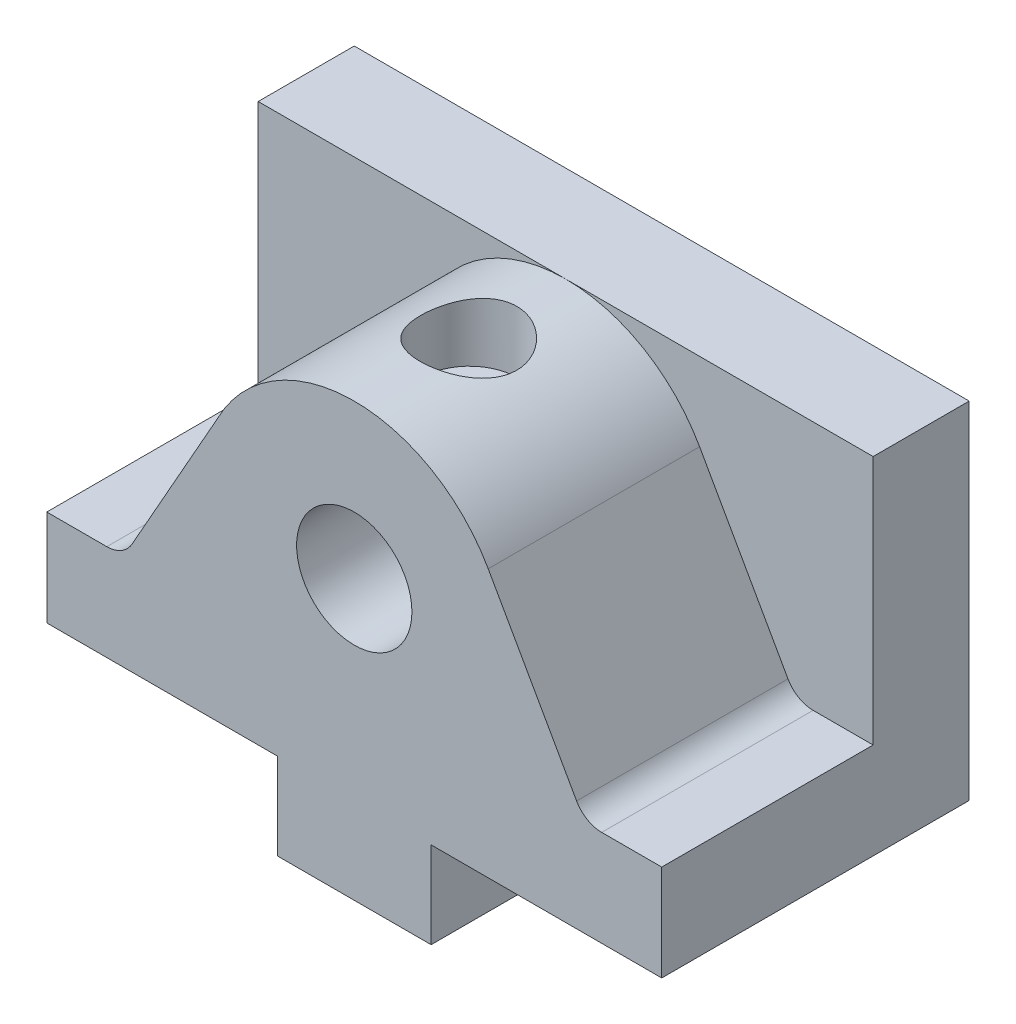
ISO-10303-21;
HEADER;
FILE_DESCRIPTION(('STEP AP214'),'2;1');
FILE_NAME('part.step','',(''),(''),'','','');
FILE_SCHEMA(('AUTOMOTIVE_DESIGN { 1 0 10303 214 1 1 1 1 }'));
ENDSEC;
DATA;
#1=APPLICATION_CONTEXT('core data for automotive mechanical design processes');
#2=APPLICATION_PROTOCOL_DEFINITION('international standard','automotive_design',2000,#1);
#3=PRODUCT_CONTEXT('',#1,'mechanical');
#4=PRODUCT('Part','Part','',(#3));
#5=PRODUCT_RELATED_PRODUCT_CATEGORY('part','',(#4));
#6=PRODUCT_DEFINITION_FORMATION('','',#4);
#7=PRODUCT_DEFINITION_CONTEXT('part definition',#1,'design');
#8=PRODUCT_DEFINITION('design','',#6,#7);
#9=PRODUCT_DEFINITION_SHAPE('','',#8);
#10=(LENGTH_UNIT() NAMED_UNIT(*) SI_UNIT(.MILLI.,.METRE.));
#11=(NAMED_UNIT(*) PLANE_ANGLE_UNIT() SI_UNIT($,.RADIAN.));
#12=(NAMED_UNIT(*) SI_UNIT($,.STERADIAN.) SOLID_ANGLE_UNIT());
#13=UNCERTAINTY_MEASURE_WITH_UNIT(LENGTH_MEASURE(1.E-05),#10,'distance_accuracy_value','');
#14=(GEOMETRIC_REPRESENTATION_CONTEXT(3) GLOBAL_UNCERTAINTY_ASSIGNED_CONTEXT((#13)) GLOBAL_UNIT_ASSIGNED_CONTEXT((#10,
#11,#12)) REPRESENTATION_CONTEXT('',''));
#15=CARTESIAN_POINT('',(0.,0.,0.));
#16=DIRECTION('',(0.,0.,1.));
#17=DIRECTION('',(1.,0.,0.));
#18=AXIS2_PLACEMENT_3D('',#15,#16,#17);
#19=CARTESIAN_POINT('',(0.,0.,0.));
#20=DIRECTION('',(0.,1.,0.));
#21=DIRECTION('',(0.,0.,1.));
#22=AXIS2_PLACEMENT_3D('',#19,#20,#21);
#23=PLANE('',#22);
#24=DIRECTION('',(0.,0.,1.));
#25=VECTOR('',#24,1.);
#26=CARTESIAN_POINT('',(8.,0.,16.));
#27=LINE('',#26,#25);
#28=CARTESIAN_POINT('',(8.,0.,-16.));
#29=VERTEX_POINT('',#28);
#30=CARTESIAN_POINT('',(8.,0.,16.));
#31=VERTEX_POINT('',#30);
#32=EDGE_CURVE('E54',#29,#31,#27,.T.);
#33=ORIENTED_EDGE('',*,*,#32,.F.);
#34=DIRECTION('',(-1.,0.,0.));
#35=VECTOR('',#34,1.);
#36=CARTESIAN_POINT('',(-32.,0.,-16.));
#37=LINE('',#36,#35);
#38=CARTESIAN_POINT('',(32.,0.,-16.));
#39=VERTEX_POINT('',#38);
#40=EDGE_CURVE('E254',#39,#29,#37,.T.);
#41=ORIENTED_EDGE('',*,*,#40,.F.);
#42=DIRECTION('',(0.,0.,-1.));
#43=VECTOR('',#42,1.);
#44=CARTESIAN_POINT('',(32.,0.,-16.));
#45=LINE('',#44,#43);
#46=CARTESIAN_POINT('',(32.,0.,16.));
#47=VERTEX_POINT('',#46);
#48=EDGE_CURVE('E354',#47,#39,#45,.T.);
#49=ORIENTED_EDGE('',*,*,#48,.F.);
#50=DIRECTION('',(1.,0.,0.));
#51=VECTOR('',#50,1.);
#52=CARTESIAN_POINT('',(-32.,0.,16.));
#53=LINE('',#52,#51);
#54=EDGE_CURVE('E59',#31,#47,#53,.T.);
#55=ORIENTED_EDGE('',*,*,#54,.F.);
#56=EDGE_LOOP('',(#33,#41,#49,#55));
#57=FACE_BOUND('',#56,.T.);
#58=ADVANCED_FACE('F34',(#57),#23,.F.);
#59=DIRECTION('',(0.,0.,-1.));
#60=VECTOR('',#59,1.);
#61=CARTESIAN_POINT('',(-8.,0.,16.));
#62=LINE('',#61,#60);
#63=CARTESIAN_POINT('',(-8.,0.,16.));
#64=VERTEX_POINT('',#63);
#65=CARTESIAN_POINT('',(-8.,0.,-16.));
#66=VERTEX_POINT('',#65);
#67=EDGE_CURVE('E278',#64,#66,#62,.T.);
#68=ORIENTED_EDGE('',*,*,#67,.F.);
#69=CARTESIAN_POINT('',(-32.,0.,16.));
#70=VERTEX_POINT('',#69);
#71=EDGE_CURVE('E363',#70,#64,#53,.T.);
#72=ORIENTED_EDGE('',*,*,#71,.F.);
#73=DIRECTION('',(0.,0.,1.));
#74=VECTOR('',#73,1.);
#75=CARTESIAN_POINT('',(-32.,0.,-16.));
#76=LINE('',#75,#74);
#77=CARTESIAN_POINT('',(-32.,0.,-16.));
#78=VERTEX_POINT('',#77);
#79=EDGE_CURVE('E262',#78,#70,#76,.T.);
#80=ORIENTED_EDGE('',*,*,#79,.F.);
#81=EDGE_CURVE('E263',#66,#78,#37,.T.);
#82=ORIENTED_EDGE('',*,*,#81,.F.);
#83=EDGE_LOOP('',(#68,#72,#80,#82));
#84=FACE_BOUND('',#83,.T.);
#85=ADVANCED_FACE('F223',(#84),#23,.F.);
#86=CARTESIAN_POINT('',(0.,36.,0.));
#87=DIRECTION('',(0.,1.,0.));
#88=DIRECTION('',(0.,0.,1.));
#89=AXIS2_PLACEMENT_3D('',#86,#87,#88);
#90=PLANE('',#89);
#91=DIRECTION('',(-1.,0.,0.));
#92=VECTOR('',#91,1.);
#93=CARTESIAN_POINT('',(0.,36.,-6.));
#94=LINE('',#93,#92);
#95=CARTESIAN_POINT('',(0.000475019664920515,36.,-6.));
#96=VERTEX_POINT('',#95);
#97=CARTESIAN_POINT('',(-32.,36.,-6.));
#98=VERTEX_POINT('',#97);
#99=EDGE_CURVE('E336',#96,#98,#94,.T.);
#100=ORIENTED_EDGE('',*,*,#99,.F.);
#101=DIRECTION('',(-1.,0.,0.));
#102=VECTOR('',#101,1.);
#103=CARTESIAN_POINT('',(0.,36.,-6.));
#104=LINE('',#103,#102);
#105=CARTESIAN_POINT('',(32.,36.,-6.));
#106=VERTEX_POINT('',#105);
#107=EDGE_CURVE('E299',#106,#96,#104,.T.);
#108=ORIENTED_EDGE('',*,*,#107,.F.);
#109=DIRECTION('',(0.,0.,-1.));
#110=VECTOR('',#109,1.);
#111=CARTESIAN_POINT('',(32.,36.,-16.));
#112=LINE('',#111,#110);
#113=CARTESIAN_POINT('',(32.,36.,-16.));
#114=VERTEX_POINT('',#113);
#115=EDGE_CURVE('E360',#106,#114,#112,.T.);
#116=ORIENTED_EDGE('',*,*,#115,.T.);
#117=DIRECTION('',(-1.,0.,0.));
#118=VECTOR('',#117,1.);
#119=CARTESIAN_POINT('',(-32.,36.,-16.));
#120=LINE('',#119,#118);
#121=CARTESIAN_POINT('',(-32.,36.,-16.));
#122=VERTEX_POINT('',#121);
#123=EDGE_CURVE('E362',#114,#122,#120,.T.);
#124=ORIENTED_EDGE('',*,*,#123,.T.);
#125=DIRECTION('',(0.,0.,1.));
#126=VECTOR('',#125,1.);
#127=CARTESIAN_POINT('',(-32.,36.,-16.));
#128=LINE('',#127,#126);
#129=EDGE_CURVE('E365',#122,#98,#128,.T.);
#130=ORIENTED_EDGE('',*,*,#129,.T.);
#131=EDGE_LOOP('',(#100,#108,#116,#124,#130));
#132=FACE_BOUND('',#131,.T.);
#133=ADVANCED_FACE('F228',(#132),#90,.T.);
#134=CARTESIAN_POINT('',(-32.,36.,16.));
#135=DIRECTION('',(0.,0.,-1.));
#136=DIRECTION('',(-1.,0.,0.));
#137=AXIS2_PLACEMENT_3D('',#134,#135,#136);
#138=PLANE('',#137);
#139=CARTESIAN_POINT('',(0.000475019664920515,20.0000000070514,16.));
#140=DIRECTION('',(0.,0.,1.));
#141=DIRECTION('',(1.,0.,0.));
#142=AXIS2_PLACEMENT_3D('',#139,#140,#141);
#143=CIRCLE('',#142,6.);
#144=CARTESIAN_POINT('',(6.00047501966492,20.0000000070514,16.));
#145=VERTEX_POINT('',#144);
#146=EDGE_CURVE('E285',#145,#145,#143,.T.);
#147=ORIENTED_EDGE('',*,*,#146,.F.);
#148=EDGE_LOOP('',(#147));
#149=FACE_BOUND('',#148,.T.);
#150=DIRECTION('',(-0.490890153340106,0.871221474341472,0.));
#151=VECTOR('',#150,1.);
#152=CARTESIAN_POINT('',(22.4933850078162,12.673908461647,16.));
#153=LINE('',#152,#151);
#154=CARTESIAN_POINT('',(23.1394254455812,11.5273295399797,16.));
#155=VERTEX_POINT('',#154);
#156=CARTESIAN_POINT('',(13.9400186091285,27.8542424604931,16.));
#157=VERTEX_POINT('',#156);
#158=EDGE_CURVE('E294',#155,#157,#153,.T.);
#159=ORIENTED_EDGE('',*,*,#158,.T.);
#160=CARTESIAN_POINT('',(0.000475019664920515,20.0000000070514,16.));
#161=DIRECTION('',(0.,0.,1.));
#162=DIRECTION('',(1.,0.,0.));
#163=AXIS2_PLACEMENT_3D('',#160,#161,#162);
#164=CIRCLE('',#163,16.);
#165=CARTESIAN_POINT('',(-14.249494850462,27.2758751228346,16.));
#166=VERTEX_POINT('',#165);
#167=EDGE_CURVE('E328',#157,#166,#164,.T.);
#168=ORIENTED_EDGE('',*,*,#167,.T.);
#169=DIRECTION('',(0.49151772046397,0.870867573440361,0.));
#170=VECTOR('',#169,1.);
#171=CARTESIAN_POINT('',(-22.4823163765116,12.6890209638625,16.));
#172=LINE('',#171,#170);
#173=CARTESIAN_POINT('',(-23.139037695663,11.5254468386081,16.));
#174=VERTEX_POINT('',#173);
#175=EDGE_CURVE('E347',#174,#166,#172,.T.);
#176=ORIENTED_EDGE('',*,*,#175,.F.);
#177=CARTESIAN_POINT('',(-25.7516404159841,13.,16.));
#178=DIRECTION('',(0.,0.,1.));
#179=DIRECTION('',(1.,0.,0.));
#180=AXIS2_PLACEMENT_3D('',#177,#178,#179);
#181=CIRCLE('',#180,3.);
#182=CARTESIAN_POINT('',(-25.7516404159841,10.,16.));
#183=VERTEX_POINT('',#182);
#184=EDGE_CURVE('E344',#183,#174,#181,.T.);
#185=ORIENTED_EDGE('',*,*,#184,.F.);
#186=DIRECTION('',(1.,0.,0.));
#187=VECTOR('',#186,1.);
#188=CARTESIAN_POINT('',(0.,10.,16.));
#189=LINE('',#188,#187);
#190=CARTESIAN_POINT('',(-32.,10.,16.));
#191=VERTEX_POINT('',#190);
#192=EDGE_CURVE('E316',#191,#183,#189,.T.);
#193=ORIENTED_EDGE('',*,*,#192,.F.);
#194=DIRECTION('',(0.,-1.,0.));
#195=VECTOR('',#194,1.);
#196=CARTESIAN_POINT('',(-32.,36.,16.));
#197=LINE('',#196,#195);
#198=EDGE_CURVE('E376',#191,#70,#197,.T.);
#199=ORIENTED_EDGE('',*,*,#198,.T.);
#200=ORIENTED_EDGE('',*,*,#71,.T.);
#201=DIRECTION('',(0.,1.,0.));
#202=VECTOR('',#201,1.);
#203=CARTESIAN_POINT('',(-8.,-9.,16.));
#204=LINE('',#203,#202);
#205=CARTESIAN_POINT('',(-8.,-9.,16.));
#206=VERTEX_POINT('',#205);
#207=EDGE_CURVE('E273',#206,#64,#204,.T.);
#208=ORIENTED_EDGE('',*,*,#207,.F.);
#209=DIRECTION('',(-1.,0.,0.));
#210=VECTOR('',#209,1.);
#211=CARTESIAN_POINT('',(-8.,-9.,16.));
#212=LINE('',#211,#210);
#213=CARTESIAN_POINT('',(8.,-9.,16.));
#214=VERTEX_POINT('',#213);
#215=EDGE_CURVE('E395',#214,#206,#212,.T.);
#216=ORIENTED_EDGE('',*,*,#215,.F.);
#217=DIRECTION('',(0.,1.,0.));
#218=VECTOR('',#217,1.);
#219=CARTESIAN_POINT('',(8.,-9.,16.));
#220=LINE('',#219,#218);
#221=EDGE_CURVE('E283',#214,#31,#220,.T.);
#222=ORIENTED_EDGE('',*,*,#221,.T.);
#223=ORIENTED_EDGE('',*,*,#54,.T.);
#224=DIRECTION('',(0.,-1.,0.));
#225=VECTOR('',#224,1.);
#226=CARTESIAN_POINT('',(32.,36.,16.));
#227=LINE('',#226,#225);
#228=CARTESIAN_POINT('',(32.,10.,16.));
#229=VERTEX_POINT('',#228);
#230=EDGE_CURVE('E368',#229,#47,#227,.T.);
#231=ORIENTED_EDGE('',*,*,#230,.F.);
#232=DIRECTION('',(1.,0.,0.));
#233=VECTOR('',#232,1.);
#234=CARTESIAN_POINT('',(0.,9.99999999999999,16.));
#235=LINE('',#234,#233);
#236=CARTESIAN_POINT('',(25.7530898686056,10.,16.));
#237=VERTEX_POINT('',#236);
#238=EDGE_CURVE('E309',#237,#229,#235,.T.);
#239=ORIENTED_EDGE('',*,*,#238,.F.);
#240=CARTESIAN_POINT('',(25.7530898686056,13.,16.));
#241=DIRECTION('',(0.,0.,1.));
#242=DIRECTION('',(1.,0.,0.));
#243=AXIS2_PLACEMENT_3D('',#240,#241,#242);
#244=CIRCLE('',#243,3.);
#245=EDGE_CURVE('E287',#237,#155,#244,.F.);
#246=ORIENTED_EDGE('',*,*,#245,.T.);
#247=EDGE_LOOP('',(#159,#168,#176,#185,#193,#199,#200,#208,#216,#222,#223,#231,#239,#246));
#248=FACE_BOUND('',#247,.T.);
#249=ADVANCED_FACE('F233',(#149,#248),#138,.F.);
#250=CARTESIAN_POINT('',(32.,36.,-16.));
#251=DIRECTION('',(-1.,0.,0.));
#252=DIRECTION('',(0.,0.,1.));
#253=AXIS2_PLACEMENT_3D('',#250,#251,#252);
#254=PLANE('',#253);
#255=DIRECTION('',(0.,1.,0.));
#256=VECTOR('',#255,1.);
#257=CARTESIAN_POINT('',(32.,0.,-6.));
#258=LINE('',#257,#256);
#259=CARTESIAN_POINT('',(32.,10.,-6.));
#260=VERTEX_POINT('',#259);
#261=EDGE_CURVE('E297',#260,#106,#258,.T.);
#262=ORIENTED_EDGE('',*,*,#261,.F.);
#263=DIRECTION('',(0.,0.,1.));
#264=VECTOR('',#263,1.);
#265=CARTESIAN_POINT('',(32.,10.,-6.));
#266=LINE('',#265,#264);
#267=EDGE_CURVE('E320',#260,#229,#266,.T.);
#268=ORIENTED_EDGE('',*,*,#267,.T.);
#269=ORIENTED_EDGE('',*,*,#230,.T.);
#270=ORIENTED_EDGE('',*,*,#48,.T.);
#271=DIRECTION('',(0.,-1.,0.));
#272=VECTOR('',#271,1.);
#273=CARTESIAN_POINT('',(32.,36.,-16.));
#274=LINE('',#273,#272);
#275=EDGE_CURVE('E47',#114,#39,#274,.T.);
#276=ORIENTED_EDGE('',*,*,#275,.F.);
#277=ORIENTED_EDGE('',*,*,#115,.F.);
#278=EDGE_LOOP('',(#262,#268,#269,#270,#276,#277));
#279=FACE_BOUND('',#278,.T.);
#280=ADVANCED_FACE('F36',(#279),#254,.F.);
#281=CARTESIAN_POINT('',(-32.,36.,-16.));
#282=DIRECTION('',(0.,0.,1.));
#283=DIRECTION('',(1.,0.,0.));
#284=AXIS2_PLACEMENT_3D('',#281,#282,#283);
#285=PLANE('',#284);
#286=CARTESIAN_POINT('',(0.000475019664920515,20.0000000070514,-16.));
#287=DIRECTION('',(0.,0.,1.));
#288=DIRECTION('',(1.,0.,0.));
#289=AXIS2_PLACEMENT_3D('',#286,#287,#288);
#290=CIRCLE('',#289,6.);
#291=CARTESIAN_POINT('',(6.00047501966492,20.0000000070514,-16.));
#292=VERTEX_POINT('',#291);
#293=EDGE_CURVE('E251',#292,#292,#290,.T.);
#294=ORIENTED_EDGE('',*,*,#293,.T.);
#295=EDGE_LOOP('',(#294));
#296=FACE_BOUND('',#295,.T.);
#297=ORIENTED_EDGE('',*,*,#40,.T.);
#298=DIRECTION('',(0.,1.,0.));
#299=VECTOR('',#298,1.);
#300=CARTESIAN_POINT('',(8.,-9.,-16.));
#301=LINE('',#300,#299);
#302=CARTESIAN_POINT('',(8.,-9.,-16.));
#303=VERTEX_POINT('',#302);
#304=EDGE_CURVE('E257',#303,#29,#301,.T.);
#305=ORIENTED_EDGE('',*,*,#304,.F.);
#306=DIRECTION('',(1.,0.,0.));
#307=VECTOR('',#306,1.);
#308=CARTESIAN_POINT('',(-8.,-9.,-16.));
#309=LINE('',#308,#307);
#310=CARTESIAN_POINT('',(-8.,-9.,-16.));
#311=VERTEX_POINT('',#310);
#312=EDGE_CURVE('E270',#311,#303,#309,.T.);
#313=ORIENTED_EDGE('',*,*,#312,.F.);
#314=DIRECTION('',(0.,1.,0.));
#315=VECTOR('',#314,1.);
#316=CARTESIAN_POINT('',(-8.,-9.,-16.));
#317=LINE('',#316,#315);
#318=EDGE_CURVE('E269',#311,#66,#317,.T.);
#319=ORIENTED_EDGE('',*,*,#318,.T.);
#320=ORIENTED_EDGE('',*,*,#81,.T.);
#321=DIRECTION('',(0.,-1.,0.));
#322=VECTOR('',#321,1.);
#323=CARTESIAN_POINT('',(-32.,36.,-16.));
#324=LINE('',#323,#322);
#325=EDGE_CURVE('E378',#122,#78,#324,.T.);
#326=ORIENTED_EDGE('',*,*,#325,.F.);
#327=ORIENTED_EDGE('',*,*,#123,.F.);
#328=ORIENTED_EDGE('',*,*,#275,.T.);
#329=EDGE_LOOP('',(#297,#305,#313,#319,#320,#326,#327,#328));
#330=FACE_BOUND('',#329,.T.);
#331=ADVANCED_FACE('F240',(#296,#330),#285,.F.);
#332=CARTESIAN_POINT('',(-32.,36.,-16.));
#333=DIRECTION('',(1.,0.,0.));
#334=DIRECTION('',(0.,0.,-1.));
#335=AXIS2_PLACEMENT_3D('',#332,#333,#334);
#336=PLANE('',#335);
#337=ORIENTED_EDGE('',*,*,#198,.F.);
#338=DIRECTION('',(0.,0.,1.));
#339=VECTOR('',#338,1.);
#340=CARTESIAN_POINT('',(-32.,10.,-6.));
#341=LINE('',#340,#339);
#342=CARTESIAN_POINT('',(-32.,10.,-6.));
#343=VERTEX_POINT('',#342);
#344=EDGE_CURVE('E352',#343,#191,#341,.T.);
#345=ORIENTED_EDGE('',*,*,#344,.F.);
#346=DIRECTION('',(0.,-1.,0.));
#347=VECTOR('',#346,1.);
#348=CARTESIAN_POINT('',(-32.,0.,-6.));
#349=LINE('',#348,#347);
#350=EDGE_CURVE('E338',#98,#343,#349,.T.);
#351=ORIENTED_EDGE('',*,*,#350,.F.);
#352=ORIENTED_EDGE('',*,*,#129,.F.);
#353=ORIENTED_EDGE('',*,*,#325,.T.);
#354=ORIENTED_EDGE('',*,*,#79,.T.);
#355=EDGE_LOOP('',(#337,#345,#351,#352,#353,#354));
#356=FACE_BOUND('',#355,.T.);
#357=ADVANCED_FACE('F237',(#356),#336,.F.);
#358=CARTESIAN_POINT('',(0.,10.,-6.));
#359=DIRECTION('',(0.,-1.,0.));
#360=DIRECTION('',(0.,0.,-1.));
#361=AXIS2_PLACEMENT_3D('',#358,#359,#360);
#362=PLANE('',#361);
#363=ORIENTED_EDGE('',*,*,#192,.T.);
#364=DIRECTION('',(0.,0.,1.));
#365=VECTOR('',#364,1.);
#366=CARTESIAN_POINT('',(-25.7516404159841,10.,-6.));
#367=LINE('',#366,#365);
#368=CARTESIAN_POINT('',(-25.7516404159841,10.,-6.));
#369=VERTEX_POINT('',#368);
#370=EDGE_CURVE('E341',#369,#183,#367,.T.);
#371=ORIENTED_EDGE('',*,*,#370,.F.);
#372=DIRECTION('',(1.,0.,0.));
#373=VECTOR('',#372,1.);
#374=CARTESIAN_POINT('',(0.,10.,-6.));
#375=LINE('',#374,#373);
#376=EDGE_CURVE('E324',#343,#369,#375,.T.);
#377=ORIENTED_EDGE('',*,*,#376,.F.);
#378=ORIENTED_EDGE('',*,*,#344,.T.);
#379=EDGE_LOOP('',(#363,#371,#377,#378));
#380=FACE_BOUND('',#379,.T.);
#381=ADVANCED_FACE('F239',(#380),#362,.F.);
#382=CARTESIAN_POINT('',(0.000475019664920515,20.0000000070514,-6.));
#383=DIRECTION('',(0.,0.,1.));
#384=DIRECTION('',(1.,0.,0.));
#385=AXIS2_PLACEMENT_3D('',#382,#383,#384);
#386=CYLINDRICAL_SURFACE('',#385,16.);
#387=CARTESIAN_POINT('',(-5.09113410060959,35.1682403982878,3.99999999787987));
#388=CARTESIAN_POINT('',(-5.09113226201976,35.1682420946889,4.27338814233143));
#389=CARTESIAN_POINT('',(-5.06868105366861,35.1758331119984,4.54679507269648));
#390=CARTESIAN_POINT('',(-4.97972241168658,35.2052546723911,5.08557664138729));
#391=CARTESIAN_POINT('',(-4.91320307236802,35.2270890635179,5.35094908880749));
#392=CARTESIAN_POINT('',(-4.73860752088135,35.2823228174397,5.86577960560889));
#393=CARTESIAN_POINT('',(-4.63060484464868,35.3157017053804,6.11526493030286));
#394=CARTESIAN_POINT('',(-4.37633737224458,35.3902892077491,6.59261078133565));
#395=CARTESIAN_POINT('',(-4.23006581665799,35.4314992050302,6.82046747772029));
#396=CARTESIAN_POINT('',(-3.89801153890166,35.5187663474244,7.25591546785389));
#397=CARTESIAN_POINT('',(-3.71114000604768,35.564934491837,7.46265443562383));
#398=CARTESIAN_POINT('',(-3.30549330121113,35.656108489464,7.84238405071659));
#399=CARTESIAN_POINT('',(-3.08671368186816,35.7011141796242,8.01536998565925));
#400=CARTESIAN_POINT('',(-2.61732134951133,35.7862351932431,8.32644424992485));
#401=CARTESIAN_POINT('',(-2.36610057966116,35.8262168896368,8.46365481320569));
#402=CARTESIAN_POINT('',(-1.84268080342608,35.8956708587575,8.69350419730206));
#403=CARTESIAN_POINT('',(-1.57048674534066,35.9251456012488,8.7861534944782));
#404=CARTESIAN_POINT('',(-1.02175246527362,35.9696101739287,8.92140451026814));
#405=CARTESIAN_POINT('',(-0.745605841612121,35.9850190909685,8.96546299703127));
#406=CARTESIAN_POINT('',(-0.189434277630818,36.0012892824094,9.00689738362996));
#407=CARTESIAN_POINT('',(0.0905897666080761,36.0021538636826,9.00428389531516));
#408=CARTESIAN_POINT('',(0.636312383616899,35.9896119609882,8.9534068315361));
#409=CARTESIAN_POINT('',(0.9021717589088,35.976697162208,8.90672246382786));
#410=CARTESIAN_POINT('',(1.42214730556969,35.9388469704939,8.77162003770779));
#411=CARTESIAN_POINT('',(1.67626270989067,35.913910793606,8.68319925753336));
#412=CARTESIAN_POINT('',(2.16917109924726,35.8543116308995,8.46611924158062));
#413=CARTESIAN_POINT('',(2.40773848362173,35.8195333318894,8.33698076362885));
#414=CARTESIAN_POINT('',(2.86034680630996,35.7440103093007,8.04251559906051));
#415=CARTESIAN_POINT('',(3.0743815215909,35.7032640778221,7.87717976132438));
#416=CARTESIAN_POINT('',(3.48125773001853,35.6182321508885,7.50690545867901));
#417=CARTESIAN_POINT('',(3.67284427712941,35.5738697166231,7.3006037225315));
#418=CARTESIAN_POINT('',(4.01906052197606,35.4881523647276,6.85841959056559));
#419=CARTESIAN_POINT('',(4.17368586668142,35.4467978017421,6.62253371551845));
#420=CARTESIAN_POINT('',(4.44303157699384,35.3715174870757,6.12433012248958));
#421=CARTESIAN_POINT('',(4.55728643996474,35.3376799658273,5.86174636191598));
#422=CARTESIAN_POINT('',(4.73949005978033,35.2823724704938,5.31976203051184));
#423=CARTESIAN_POINT('',(4.80745545390906,35.2608980533121,5.04036754110237));
#424=CARTESIAN_POINT('',(4.89271161682374,35.233776761948,4.48472018757131));
#425=CARTESIAN_POINT('',(4.91192843044369,35.2275287109051,4.20879201293934));
#426=CARTESIAN_POINT('',(4.90454554263302,35.2299086527671,3.65764103189932));
#427=CARTESIAN_POINT('',(4.87795292066195,35.2385343470612,3.38241812308121));
#428=CARTESIAN_POINT('',(4.7814321143284,35.2690817710451,2.84876681127018));
#429=CARTESIAN_POINT('',(4.7127792707348,35.2906118158345,2.59008290158307));
#430=CARTESIAN_POINT('',(4.5355950704933,35.3440930907867,2.08791282989654));
#431=CARTESIAN_POINT('',(4.42705720975401,35.3760460205248,1.84442915419534));
#432=CARTESIAN_POINT('',(4.16964783683098,35.4478571569734,1.37184355879264));
#433=CARTESIAN_POINT('',(4.01970889026013,35.4879157941074,1.14335433550871));
#434=CARTESIAN_POINT('',(3.68502168687478,35.5709278140883,0.714038612432268));
#435=CARTESIAN_POINT('',(3.5002643875442,35.6138819470457,0.513219322178543));
#436=CARTESIAN_POINT('',(3.0920988688482,35.6999063496809,0.136358534228597));
#437=CARTESIAN_POINT('',(2.86740614212982,35.7429076544802,-0.0383111466795894));
#438=CARTESIAN_POINT('',(2.39086220934232,35.8222726090865,-0.347564175405141));
#439=CARTESIAN_POINT('',(2.13901224797872,35.8586365628998,-0.48214935936427));
#440=CARTESIAN_POINT('',(1.6168726236867,35.9202946681996,-0.70612225200685));
#441=CARTESIAN_POINT('',(1.34673325786555,35.9456687696432,-0.795837153494854));
#442=CARTESIAN_POINT('',(0.794288116734958,35.9826900304391,-0.928290156478946));
#443=CARTESIAN_POINT('',(0.511986177430799,35.9943414854542,-0.971042958454091));
#444=CARTESIAN_POINT('',(-0.0441344525555877,36.0022542567627,-1.00716400911862));
#445=CARTESIAN_POINT('',(-0.317817134518317,35.9991359960848,-1.00251380280321));
#446=CARTESIAN_POINT('',(-0.860242464182416,35.9791368962742,-0.948752757925291));
#447=CARTESIAN_POINT('',(-1.12898543280356,35.9622569544552,-0.899644818152148));
#448=CARTESIAN_POINT('',(-1.65060779324108,35.9167108603556,-0.759623965231203));
#449=CARTESIAN_POINT('',(-1.90364354888704,35.8881947535887,-0.669241570739314));
#450=CARTESIAN_POINT('',(-2.39102413414184,35.8221768827104,-0.449716693285541));
#451=CARTESIAN_POINT('',(-2.62536574916462,35.7846735776088,-0.320567562223895));
#452=CARTESIAN_POINT('',(-3.07737012709103,35.7029117463889,-0.0221089687449721));
#453=CARTESIAN_POINT('',(-3.29419756934221,35.6584672398866,0.148414087725901));
#454=CARTESIAN_POINT('',(-3.69680577165421,35.5683255646736,0.522639555663598));
#455=CARTESIAN_POINT('',(-3.88257720867285,35.5226280245763,0.726351894474287));
#456=CARTESIAN_POINT('',(-4.22403198114198,35.433268367243,1.16926287720967));
#457=CARTESIAN_POINT('',(-4.37851455356457,35.3897238460691,1.40941361020927));
#458=CARTESIAN_POINT('',(-4.64480889182086,35.3114567313398,1.91359247882994));
#459=CARTESIAN_POINT('',(-4.75663791583932,35.2767305716646,2.17761090366715));
#460=CARTESIAN_POINT('',(-4.92630758450944,35.2228141240688,2.69889046715472));
#461=CARTESIAN_POINT('',(-4.98793683289914,35.2025521028401,2.95481018763579));
#462=CARTESIAN_POINT('',(-5.07034594362926,35.1752660543762,3.47381532619553));
#463=CARTESIAN_POINT('',(-5.09113587001655,35.1682387657193,3.73689896266211));
#464=CARTESIAN_POINT('',(-5.09113410060959,35.1682403982878,3.99999999787987));
#465=B_SPLINE_CURVE_WITH_KNOTS('',3,(#387,#388,#389,#390,#391,#392,#393,#394,#395,#396,#397,
#398,#399,#400,#401,#402,#403,#404,#405,#406,#407,#408,#409,#410,#411,#412,#413,#414,#415,#416,
#417,#418,#419,#420,#421,#422,#423,#424,#425,#426,#427,#428,#429,#430,#431,#432,#433,#434,#435,
#436,#437,#438,#439,#440,#441,#442,#443,#444,#445,#446,#447,#448,#449,#450,#451,#452,#453,#454,
#455,#456,#457,#458,#459,#460,#461,#462,#463,#464),.UNSPECIFIED.,.T.,.F.,(4,2,2,2,2,2,2,2,2,2,2,
2,2,2,2,2,2,2,2,2,2,2,2,2,2,2,2,2,2,2,2,2,2,2,2,2,2,2,4),(0.,0.819192550193961,1.63860650823894,
2.45657457647433,3.27468721969979,4.11828322203353,4.9619969176449,5.82479287854932,
6.68738589671687,7.52334891342134,8.35912185887097,9.16603931879001,9.97300940760371,
10.7898561843363,11.6069097085275,12.4580135574933,13.309217594151,14.1699388374229,
15.0303505582074,15.8561973316147,16.6819164888608,17.4837588818718,18.2857320902257,
19.1107045324817,19.9358915205725,20.7952775125577,21.6546241327807,22.5076095717372,
23.3603279257206,24.1775520976782,24.9947229877895,25.8016738606876,26.6087631965633,
27.4432277243059,28.2779423109849,29.1403118201788,30.002332032282,30.7908941750128,
31.5792619677387),.UNSPECIFIED.);
#466=CARTESIAN_POINT('',(-5.09113410060959,35.1682403982878,3.99999999787987));
#467=VERTEX_POINT('',#466);
#468=EDGE_CURVE('E11',#467,#467,#465,.T.);
#469=ORIENTED_EDGE('',*,*,#468,.F.);
#470=EDGE_LOOP('',(#469));
#471=FACE_BOUND('',#470,.T.);
#472=ORIENTED_EDGE('',*,*,#167,.F.);
#473=DIRECTION('',(0.,0.,1.));
#474=VECTOR('',#473,1.);
#475=CARTESIAN_POINT('',(13.9400186091285,27.8542424604931,-6.));
#476=LINE('',#475,#474);
#477=CARTESIAN_POINT('',(13.9400186091285,27.8542424604931,-6.));
#478=VERTEX_POINT('',#477);
#479=EDGE_CURVE('E317',#478,#157,#476,.T.);
#480=ORIENTED_EDGE('',*,*,#479,.F.);
#481=CARTESIAN_POINT('',(0.000475019664920515,20.0000000070514,-6.));
#482=DIRECTION('',(0.,0.,1.));
#483=DIRECTION('',(1.,0.,0.));
#484=AXIS2_PLACEMENT_3D('',#481,#482,#483);
#485=CIRCLE('',#484,16.);
#486=EDGE_CURVE('E301',#478,#96,#485,.T.);
#487=ORIENTED_EDGE('',*,*,#486,.T.);
#488=CARTESIAN_POINT('',(0.000475019664920515,20.0000000070514,-6.));
#489=DIRECTION('',(0.,0.,1.));
#490=DIRECTION('',(1.,0.,0.));
#491=AXIS2_PLACEMENT_3D('',#488,#489,#490);
#492=CIRCLE('',#491,16.);
#493=CARTESIAN_POINT('',(-14.249494850462,27.2758751228346,-6.));
#494=VERTEX_POINT('',#493);
#495=EDGE_CURVE('E334',#96,#494,#492,.T.);
#496=ORIENTED_EDGE('',*,*,#495,.T.);
#497=DIRECTION('',(0.,0.,1.));
#498=VECTOR('',#497,1.);
#499=CARTESIAN_POINT('',(-14.249494850462,27.2758751228346,-6.));
#500=LINE('',#499,#498);
#501=EDGE_CURVE('E355',#494,#166,#500,.T.);
#502=ORIENTED_EDGE('',*,*,#501,.T.);
#503=EDGE_LOOP('',(#472,#480,#487,#496,#502));
#504=FACE_BOUND('',#503,.T.);
#505=ADVANCED_FACE('F419',(#471,#504),#386,.T.);
#506=CARTESIAN_POINT('',(-22.4823163765116,12.6890209638625,-6.));
#507=DIRECTION('',(0.870867573440361,-0.49151772046397,0.));
#508=DIRECTION('',(0.49151772046397,0.870867573440361,0.));
#509=AXIS2_PLACEMENT_3D('',#506,#507,#508);
#510=PLANE('',#509);
#511=ORIENTED_EDGE('',*,*,#175,.T.);
#512=ORIENTED_EDGE('',*,*,#501,.F.);
#513=DIRECTION('',(0.49151772046397,0.870867573440361,0.));
#514=VECTOR('',#513,1.);
#515=CARTESIAN_POINT('',(-22.4823163765116,12.6890209638625,-6.));
#516=LINE('',#515,#514);
#517=CARTESIAN_POINT('',(-23.139037695663,11.5254468386081,-6.));
#518=VERTEX_POINT('',#517);
#519=EDGE_CURVE('E331',#518,#494,#516,.T.);
#520=ORIENTED_EDGE('',*,*,#519,.F.);
#521=DIRECTION('',(0.,0.,1.));
#522=VECTOR('',#521,1.);
#523=CARTESIAN_POINT('',(-23.139037695663,11.5254468386081,-6.));
#524=LINE('',#523,#522);
#525=EDGE_CURVE('E357',#518,#174,#524,.T.);
#526=ORIENTED_EDGE('',*,*,#525,.T.);
#527=EDGE_LOOP('',(#511,#512,#520,#526));
#528=FACE_BOUND('',#527,.T.);
#529=ADVANCED_FACE('F424',(#528),#510,.F.);
#530=CARTESIAN_POINT('',(-25.7516404159841,13.,-6.));
#531=DIRECTION('',(0.,0.,1.));
#532=DIRECTION('',(1.,0.,0.));
#533=AXIS2_PLACEMENT_3D('',#530,#531,#532);
#534=CYLINDRICAL_SURFACE('',#533,3.);
#535=ORIENTED_EDGE('',*,*,#184,.T.);
#536=ORIENTED_EDGE('',*,*,#525,.F.);
#537=CARTESIAN_POINT('',(-25.7516404159841,13.,-6.));
#538=DIRECTION('',(0.,0.,1.));
#539=DIRECTION('',(1.,0.,0.));
#540=AXIS2_PLACEMENT_3D('',#537,#538,#539);
#541=CIRCLE('',#540,3.);
#542=EDGE_CURVE('E327',#369,#518,#541,.T.);
#543=ORIENTED_EDGE('',*,*,#542,.F.);
#544=ORIENTED_EDGE('',*,*,#370,.T.);
#545=EDGE_LOOP('',(#535,#536,#543,#544));
#546=FACE_BOUND('',#545,.T.);
#547=ADVANCED_FACE('F427',(#546),#534,.F.);
#548=CARTESIAN_POINT('',(0.,0.,-6.));
#549=DIRECTION('',(0.,0.,1.));
#550=DIRECTION('',(1.,0.,0.));
#551=AXIS2_PLACEMENT_3D('',#548,#549,#550);
#552=PLANE('',#551);
#553=ORIENTED_EDGE('',*,*,#376,.T.);
#554=ORIENTED_EDGE('',*,*,#542,.T.);
#555=ORIENTED_EDGE('',*,*,#519,.T.);
#556=ORIENTED_EDGE('',*,*,#495,.F.);
#557=ORIENTED_EDGE('',*,*,#99,.T.);
#558=ORIENTED_EDGE('',*,*,#350,.T.);
#559=EDGE_LOOP('',(#553,#554,#555,#556,#557,#558));
#560=FACE_BOUND('',#559,.T.);
#561=ADVANCED_FACE('F431',(#560),#552,.T.);
#562=CARTESIAN_POINT('',(25.7530898686056,13.,-6.));
#563=DIRECTION('',(0.,0.,1.));
#564=DIRECTION('',(1.,0.,0.));
#565=AXIS2_PLACEMENT_3D('',#562,#563,#564);
#566=CYLINDRICAL_SURFACE('',#565,3.);
#567=ORIENTED_EDGE('',*,*,#245,.F.);
#568=DIRECTION('',(0.,0.,1.));
#569=VECTOR('',#568,1.);
#570=CARTESIAN_POINT('',(25.7530898686056,10.,-6.));
#571=LINE('',#570,#569);
#572=CARTESIAN_POINT('',(25.7530898686056,10.,-6.));
#573=VERTEX_POINT('',#572);
#574=EDGE_CURVE('E306',#573,#237,#571,.T.);
#575=ORIENTED_EDGE('',*,*,#574,.F.);
#576=CARTESIAN_POINT('',(25.7530898686056,13.,-6.));
#577=DIRECTION('',(0.,0.,1.));
#578=DIRECTION('',(1.,0.,0.));
#579=AXIS2_PLACEMENT_3D('',#576,#577,#578);
#580=CIRCLE('',#579,3.);
#581=CARTESIAN_POINT('',(23.1394254455812,11.5273295399797,-6.));
#582=VERTEX_POINT('',#581);
#583=EDGE_CURVE('E290',#573,#582,#580,.F.);
#584=ORIENTED_EDGE('',*,*,#583,.T.);
#585=DIRECTION('',(0.,0.,1.));
#586=VECTOR('',#585,1.);
#587=CARTESIAN_POINT('',(23.1394254455812,11.5273295399797,-6.));
#588=LINE('',#587,#586);
#589=EDGE_CURVE('E313',#582,#155,#588,.T.);
#590=ORIENTED_EDGE('',*,*,#589,.T.);
#591=EDGE_LOOP('',(#567,#575,#584,#590));
#592=FACE_BOUND('',#591,.T.);
#593=ADVANCED_FACE('F412',(#592),#566,.F.);
#594=CARTESIAN_POINT('',(22.4933850078162,12.673908461647,-6.));
#595=DIRECTION('',(0.871221474341472,0.490890153340106,0.));
#596=DIRECTION('',(-0.490890153340106,0.871221474341472,0.));
#597=AXIS2_PLACEMENT_3D('',#594,#595,#596);
#598=PLANE('',#597);
#599=ORIENTED_EDGE('',*,*,#158,.F.);
#600=ORIENTED_EDGE('',*,*,#589,.F.);
#601=DIRECTION('',(-0.490890153340106,0.871221474341472,0.));
#602=VECTOR('',#601,1.);
#603=CARTESIAN_POINT('',(22.4933850078162,12.673908461647,-6.));
#604=LINE('',#603,#602);
#605=EDGE_CURVE('E304',#582,#478,#604,.T.);
#606=ORIENTED_EDGE('',*,*,#605,.T.);
#607=ORIENTED_EDGE('',*,*,#479,.T.);
#608=EDGE_LOOP('',(#599,#600,#606,#607));
#609=FACE_BOUND('',#608,.T.);
#610=ADVANCED_FACE('F414',(#609),#598,.T.);
#611=CARTESIAN_POINT('',(0.,9.99999999999999,-6.));
#612=DIRECTION('',(0.,-1.,0.));
#613=DIRECTION('',(1.,0.,0.));
#614=AXIS2_PLACEMENT_3D('',#611,#612,#613);
#615=PLANE('',#614);
#616=ORIENTED_EDGE('',*,*,#238,.T.);
#617=ORIENTED_EDGE('',*,*,#267,.F.);
#618=DIRECTION('',(1.,0.,0.));
#619=VECTOR('',#618,1.);
#620=CARTESIAN_POINT('',(0.,9.99999999999999,-6.));
#621=LINE('',#620,#619);
#622=EDGE_CURVE('E293',#573,#260,#621,.T.);
#623=ORIENTED_EDGE('',*,*,#622,.F.);
#624=ORIENTED_EDGE('',*,*,#574,.T.);
#625=EDGE_LOOP('',(#616,#617,#623,#624));
#626=FACE_BOUND('',#625,.T.);
#627=ADVANCED_FACE('F403',(#626),#615,.F.);
#628=CARTESIAN_POINT('',(0.,0.,-6.));
#629=DIRECTION('',(0.,0.,1.));
#630=DIRECTION('',(1.,0.,0.));
#631=AXIS2_PLACEMENT_3D('',#628,#629,#630);
#632=PLANE('',#631);
#633=ORIENTED_EDGE('',*,*,#583,.F.);
#634=ORIENTED_EDGE('',*,*,#622,.T.);
#635=ORIENTED_EDGE('',*,*,#261,.T.);
#636=ORIENTED_EDGE('',*,*,#107,.T.);
#637=ORIENTED_EDGE('',*,*,#486,.F.);
#638=ORIENTED_EDGE('',*,*,#605,.F.);
#639=EDGE_LOOP('',(#633,#634,#635,#636,#637,#638));
#640=FACE_BOUND('',#639,.T.);
#641=ADVANCED_FACE('F406',(#640),#632,.T.);
#642=CARTESIAN_POINT('',(0.000475019664920515,20.0000000070514,-16.));
#643=DIRECTION('',(0.,0.,1.));
#644=DIRECTION('',(1.,0.,0.));
#645=AXIS2_PLACEMENT_3D('',#642,#643,#644);
#646=CYLINDRICAL_SURFACE('',#645,6.);
#647=CARTESIAN_POINT('',(-3.03082097439131,25.1779575770222,3.99999999787987));
#648=CARTESIAN_POINT('',(-3.0308200889498,25.1779585411895,4.07820023113897));
#649=CARTESIAN_POINT('',(-3.02776784184736,25.1797494196881,4.15640999634444));
#650=CARTESIAN_POINT('',(-3.01560992103541,25.1868364072482,4.31220807302193));
#651=CARTESIAN_POINT('',(-3.00650142914494,25.1921341481695,4.38979607814837));
#652=CARTESIAN_POINT('',(-2.97020074251796,25.2130535463344,4.6209440121263));
#653=CARTESIAN_POINT('',(-2.93403359403221,25.233700894424,4.77275090841313));
#654=CARTESIAN_POINT('',(-2.83976594870569,25.2854372960993,5.06639163140342));
#655=CARTESIAN_POINT('',(-2.78178204391788,25.3164707490141,5.20827379963077));
#656=CARTESIAN_POINT('',(-2.64586816965731,25.3854122439458,5.48026275958069));
#657=CARTESIAN_POINT('',(-2.56793712112785,25.4233206578369,5.61036891375479));
#658=CARTESIAN_POINT('',(-2.38678570704498,25.5056026921985,5.8669201440276));
#659=CARTESIAN_POINT('',(-2.28200966509183,25.5502516734152,5.9921782000358));
#660=CARTESIAN_POINT('',(-2.05334548741461,25.638870615954,6.22422436756942));
#661=CARTESIAN_POINT('',(-1.92944787634996,25.682840228679,6.33100326613657));
#662=CARTESIAN_POINT('',(-1.65582917772538,25.76875610789,6.53010168561221));
#663=CARTESIAN_POINT('',(-1.50493035865607,25.8103661996446,6.6209613638071));
#664=CARTESIAN_POINT('',(-1.18751511260162,25.8834621317672,6.77542249530795));
#665=CARTESIAN_POINT('',(-1.02100862297666,25.9149543583484,6.83904115112645));
#666=CARTESIAN_POINT('',(-0.689645818445688,25.9623585730417,6.93251399586905));
#667=CARTESIAN_POINT('',(-0.525515100454727,25.9792197203002,6.96444857752793));
#668=CARTESIAN_POINT('',(-0.193435921815031,25.9991667684021,7.00049835332389));
#669=CARTESIAN_POINT('',(-0.0254898329298496,26.0022610037874,7.00463038001213));
#670=CARTESIAN_POINT('',(0.293808947734306,25.994768384081,6.98575996524507));
#671=CARTESIAN_POINT('',(0.44533457683566,25.9853478474433,6.96508590980183));
#672=CARTESIAN_POINT('',(0.742495877534014,25.9558126999966,6.90135750768339));
#673=CARTESIAN_POINT('',(0.888131107509341,25.9356972889528,6.85830148630199));
#674=CARTESIAN_POINT('',(1.17190987505965,25.8863223929497,6.7507521421103));
#675=CARTESIAN_POINT('',(1.30992188443339,25.8569402462348,6.68597046667923));
#676=CARTESIAN_POINT('',(1.5734899387837,25.7917255320258,6.53721034117192));
#677=CARTESIAN_POINT('',(1.69904150121001,25.7558906561654,6.45322501837021));
#678=CARTESIAN_POINT('',(1.94677930423967,25.6771778055158,6.25931152394033));
#679=CARTESIAN_POINT('',(2.06752557275527,25.6339542648999,6.14768148723822));
#680=CARTESIAN_POINT('',(2.28935636102066,25.5475419550229,5.90624025597101));
#681=CARTESIAN_POINT('',(2.39042575326005,25.5043532377367,5.77641520398419));
#682=CARTESIAN_POINT('',(2.5763479292416,25.4199608408911,5.49201785453915));
#683=CARTESIAN_POINT('',(2.65976330933384,25.3790573877184,5.33639756223389));
#684=CARTESIAN_POINT('',(2.76382014247642,25.3259213262919,5.09243694326812));
#685=CARTESIAN_POINT('',(2.79499892244522,25.3095766645081,5.0093436874751));
#686=CARTESIAN_POINT('',(2.84998172575849,25.2802731354656,4.84019139484544));
#687=CARTESIAN_POINT('',(2.87379029672711,25.2673121811418,4.75413422340508));
#688=CARTESIAN_POINT('',(2.91211463502843,25.2462172151271,4.58662837765584));
#689=CARTESIAN_POINT('',(2.92721462171346,25.2377834290125,4.50535057224203));
#690=CARTESIAN_POINT('',(2.95064538098616,25.224622106138,4.34156475921397));
#691=CARTESIAN_POINT('',(2.95897967384387,25.2198926420209,4.25905741413155));
#692=CARTESIAN_POINT('',(2.96875535037383,25.2143404412106,4.09352899107716));
#693=CARTESIAN_POINT('',(2.97019930070261,25.2135162498019,4.01050811593617));
#694=CARTESIAN_POINT('',(2.96618729756281,25.2157978769464,3.84471353711522));
#695=CARTESIAN_POINT('',(2.96073180983395,25.2189034302261,3.76193981712935));
#696=CARTESIAN_POINT('',(2.93605778252549,25.2328518012718,3.53314086183718));
#697=CARTESIAN_POINT('',(2.90942715792959,25.2478380766574,3.3880891876166));
#698=CARTESIAN_POINT('',(2.83571242956404,25.2880191129308,3.104869087083));
#699=CARTESIAN_POINT('',(2.78862170201303,25.3132171796199,2.96670290604965));
#700=CARTESIAN_POINT('',(2.67305247498135,25.3723103893273,2.69377389395994));
#701=CARTESIAN_POINT('',(2.60368441049297,25.4065542869664,2.55946506997577));
#702=CARTESIAN_POINT('',(2.44632047477574,25.4795398456305,2.30359005951383));
#703=CARTESIAN_POINT('',(2.35831503445621,25.518283812519,2.1820304670684));
#704=CARTESIAN_POINT('',(2.15322803661862,25.6017304917812,1.939064371248));
#705=CARTESIAN_POINT('',(2.03387968439127,25.6465686979612,1.81960872697985));
#706=CARTESIAN_POINT('',(1.77613214657367,25.7328446700205,1.60176310258503));
#707=CARTESIAN_POINT('',(1.63772655167003,25.7742812843643,1.50338023820437));
#708=CARTESIAN_POINT('',(1.34080734206499,25.8504341455339,1.32827887030622));
#709=CARTESIAN_POINT('',(1.18185944310936,25.8849441675757,1.25220065599678));
#710=CARTESIAN_POINT('',(0.851208543834098,25.9417416382399,1.12858627356927));
#711=CARTESIAN_POINT('',(0.67951689307861,25.9640398178551,1.08102504303791));
#712=CARTESIAN_POINT('',(0.345266763709084,25.9922145947159,1.01989430603075));
#713=CARTESIAN_POINT('',(0.183315689555595,25.9994101988198,1.00360636231908));
#714=CARTESIAN_POINT('',(-0.141109202231915,26.0005188955111,0.997470209446334));
#715=CARTESIAN_POINT('',(-0.303582816978212,25.9944366379432,1.0076127446967));
#716=CARTESIAN_POINT('',(-0.613172227826165,25.9704253534454,1.05224918801337));
#717=CARTESIAN_POINT('',(-0.760594545619414,25.9533033727684,1.08509443554553));
#718=CARTESIAN_POINT('',(-1.04753677654703,25.9095472529036,1.17198110591192));
#719=CARTESIAN_POINT('',(-1.18705555313754,25.8829117496564,1.22602556842234));
#720=CARTESIAN_POINT('',(-1.46094256707789,25.8210666210574,1.35618072656861));
#721=CARTESIAN_POINT('',(-1.59483529158907,25.7855390017645,1.43313633941615));
#722=CARTESIAN_POINT('',(-1.84833173089113,25.7095929251865,1.60587541929343));
#723=CARTESIAN_POINT('',(-1.9679288420882,25.6691722248524,1.7016675338686));
#724=CARTESIAN_POINT('',(-2.20198654984534,25.5826730194974,1.92038472036341));
#725=CARTESIAN_POINT('',(-2.31475143728056,25.5364317861653,2.04506131865347));
#726=CARTESIAN_POINT('',(-2.51843587433231,25.446787979734,2.31237832595001));
#727=CARTESIAN_POINT('',(-2.60933609738319,25.4033879424974,2.45503445891095));
#728=CARTESIAN_POINT('',(-2.72847093929275,25.3436801261217,2.68253179118164));
#729=CARTESIAN_POINT('',(-2.76575390317489,25.324419273984,2.76197579886229));
#730=CARTESIAN_POINT('',(-2.83339827114716,25.2887261362296,2.92435328088858));
#731=CARTESIAN_POINT('',(-2.86376324047607,25.2722923947152,3.00728493162787));
#732=CARTESIAN_POINT('',(-2.91713724420755,25.2429443981431,3.17584473024962));
#733=CARTESIAN_POINT('',(-2.94016520222644,25.2300211018654,3.26146530512123));
#734=CARTESIAN_POINT('',(-2.97862682648504,25.2082093106834,3.43485525319413));
#735=CARTESIAN_POINT('',(-2.99406580238511,25.1993179951266,3.52262307880049));
#736=CARTESIAN_POINT('',(-3.01397381683186,25.1877922595487,3.67539881563981));
#737=CARTESIAN_POINT('',(-3.02028538475534,25.1841132579321,3.74009480678686));
#738=CARTESIAN_POINT('',(-3.02870947239769,25.1791954338828,3.86985831467955));
#739=CARTESIAN_POINT('',(-3.0308217112094,25.1779567746927,3.93492585598748));
#740=CARTESIAN_POINT('',(-3.03082097439131,25.1779575770222,3.99999999787987));
#741=B_SPLINE_CURVE_WITH_KNOTS('',3,(#647,#648,#649,#650,#651,#652,#653,#654,#655,#656,#657,
#658,#659,#660,#661,#662,#663,#664,#665,#666,#667,#668,#669,#670,#671,#672,#673,#674,#675,#676,
#677,#678,#679,#680,#681,#682,#683,#684,#685,#686,#687,#688,#689,#690,#691,#692,#693,#694,#695,
#696,#697,#698,#699,#700,#701,#702,#703,#704,#705,#706,#707,#708,#709,#710,#711,#712,#713,#714,
#715,#716,#717,#718,#719,#720,#721,#722,#723,#724,#725,#726,#727,#728,#729,#730,#731,#732,#733,
#734,#735,#736,#737,#738,#739,#740),.UNSPECIFIED.,.T.,.F.,(4,2,2,2,2,2,2,2,2,2,2,2,2,2,2,2,2,2,
2,2,2,2,2,2,2,2,2,2,2,2,2,2,2,2,2,2,2,2,2,2,2,2,2,2,2,2,4),(0.,0.234529430733892,
0.469168072604263,0.938850383294532,1.40605749261242,1.87328988121657,2.37905864237582,
2.88507883741225,3.42520847204402,3.96499651379785,4.46637625391917,4.96745241546232,
5.42495462941727,5.88249108040478,6.34635774681552,6.81039068538928,7.31828744858784,
7.82657315225868,8.36713695676457,8.63752916119814,8.90775419202328,9.15669600787593,
9.40550821320574,9.65422772860786,9.90293045534219,10.3454331624118,10.7880792327729,
11.2512265518736,11.7146122462924,12.2364099671094,12.7583836090371,13.29413310208,
13.8294110539542,14.3155757713756,14.8015702635102,15.2555404058358,15.7095756650514,
16.1830301812752,16.6567025627126,17.177514915193,17.6987859450456,17.9680115893229,
18.2370981707631,18.5054849980179,18.7736837791728,18.9688338446807,19.1639969639894),.UNSPECIFIED.);
#742=CARTESIAN_POINT('',(-3.03082097439131,25.1779575770222,3.99999999787987));
#743=VERTEX_POINT('',#742);
#744=EDGE_CURVE('E185',#743,#743,#741,.T.);
#745=ORIENTED_EDGE('',*,*,#744,.T.);
#746=EDGE_LOOP('',(#745));
#747=FACE_BOUND('',#746,.T.);
#748=ORIENTED_EDGE('',*,*,#293,.F.);
#749=EDGE_LOOP('',(#748));
#750=FACE_BOUND('',#749,.T.);
#751=ORIENTED_EDGE('',*,*,#146,.T.);
#752=EDGE_LOOP('',(#751));
#753=FACE_BOUND('',#752,.T.);
#754=ADVANCED_FACE('F521',(#747,#750,#753),#646,.F.);
#755=CARTESIAN_POINT('',(8.,-9.,16.));
#756=DIRECTION('',(-1.,0.,0.));
#757=DIRECTION('',(0.,0.,1.));
#758=AXIS2_PLACEMENT_3D('',#755,#756,#757);
#759=PLANE('',#758);
#760=ORIENTED_EDGE('',*,*,#32,.T.);
#761=ORIENTED_EDGE('',*,*,#221,.F.);
#762=DIRECTION('',(0.,0.,1.));
#763=VECTOR('',#762,1.);
#764=CARTESIAN_POINT('',(8.,-9.,16.));
#765=LINE('',#764,#763);
#766=EDGE_CURVE('E193',#303,#214,#765,.T.);
#767=ORIENTED_EDGE('',*,*,#766,.F.);
#768=ORIENTED_EDGE('',*,*,#304,.T.);
#769=EDGE_LOOP('',(#760,#761,#767,#768));
#770=FACE_BOUND('',#769,.T.);
#771=ADVANCED_FACE('F266',(#770),#759,.F.);
#772=CARTESIAN_POINT('',(-8.,-9.,16.));
#773=DIRECTION('',(1.,0.,0.));
#774=DIRECTION('',(0.,0.,-1.));
#775=AXIS2_PLACEMENT_3D('',#772,#773,#774);
#776=PLANE('',#775);
#777=ORIENTED_EDGE('',*,*,#67,.T.);
#778=ORIENTED_EDGE('',*,*,#318,.F.);
#779=DIRECTION('',(0.,0.,-1.));
#780=VECTOR('',#779,1.);
#781=CARTESIAN_POINT('',(-8.,-9.,16.));
#782=LINE('',#781,#780);
#783=EDGE_CURVE('E275',#206,#311,#782,.T.);
#784=ORIENTED_EDGE('',*,*,#783,.F.);
#785=ORIENTED_EDGE('',*,*,#207,.T.);
#786=EDGE_LOOP('',(#777,#778,#784,#785));
#787=FACE_BOUND('',#786,.T.);
#788=ADVANCED_FACE('F392',(#787),#776,.F.);
#789=CARTESIAN_POINT('',(0.,-9.,0.));
#790=DIRECTION('',(0.,-1.,0.));
#791=DIRECTION('',(0.,0.,-1.));
#792=AXIS2_PLACEMENT_3D('',#789,#790,#791);
#793=PLANE('',#792);
#794=CARTESIAN_POINT('',(0.,-9.,-8.));
#795=DIRECTION('',(0.,-1.,0.));
#796=DIRECTION('',(0.,0.,-1.));
#797=AXIS2_PLACEMENT_3D('',#794,#795,#796);
#798=CIRCLE('',#797,3.);
#799=CARTESIAN_POINT('',(0.,-9.,-11.));
#800=VERTEX_POINT('',#799);
#801=EDGE_CURVE('E169',#800,#800,#798,.T.);
#802=ORIENTED_EDGE('',*,*,#801,.F.);
#803=EDGE_LOOP('',(#802));
#804=FACE_BOUND('',#803,.T.);
#805=CARTESIAN_POINT('',(0.,-9.,8.));
#806=DIRECTION('',(0.,-1.,0.));
#807=DIRECTION('',(0.,0.,-1.));
#808=AXIS2_PLACEMENT_3D('',#805,#806,#807);
#809=CIRCLE('',#808,3.);
#810=CARTESIAN_POINT('',(0.,-9.,5.));
#811=VERTEX_POINT('',#810);
#812=EDGE_CURVE('E168',#811,#811,#809,.T.);
#813=ORIENTED_EDGE('',*,*,#812,.F.);
#814=EDGE_LOOP('',(#813));
#815=FACE_BOUND('',#814,.T.);
#816=ORIENTED_EDGE('',*,*,#766,.T.);
#817=ORIENTED_EDGE('',*,*,#215,.T.);
#818=ORIENTED_EDGE('',*,*,#783,.T.);
#819=ORIENTED_EDGE('',*,*,#312,.T.);
#820=EDGE_LOOP('',(#816,#817,#818,#819));
#821=FACE_BOUND('',#820,.T.);
#822=ADVANCED_FACE('F202',(#804,#815,#821),#793,.T.);
#823=CARTESIAN_POINT('',(-0.0960597863544421,35.9997087866269,3.99999999787987));
#824=DIRECTION('',(-0.00603342537621006,0.999981798723472,0.));
#825=DIRECTION('',(-0.999981798723472,-0.00603342537621007,0.));
#826=AXIS2_PLACEMENT_3D('',#823,#824,#825);
#827=CYLINDRICAL_SURFACE('',#826,3.);
#828=ORIENTED_EDGE('',*,*,#744,.F.);
#829=EDGE_LOOP('',(#828));
#830=FACE_BOUND('',#829,.T.);
#831=CARTESIAN_POINT('',(-0.0574458639466977,29.5998252747967,3.99999999787987));
#832=DIRECTION('',(-0.00603342537621006,0.999981798723472,0.));
#833=DIRECTION('',(-0.999981798723472,-0.00603342537621007,0.));
#834=AXIS2_PLACEMENT_3D('',#831,#832,#833);
#835=CIRCLE('',#834,3.00000000000001);
#836=CARTESIAN_POINT('',(-3.05739126011712,29.5817249986681,3.99999999787987));
#837=VERTEX_POINT('',#836);
#838=EDGE_CURVE('E182',#837,#837,#835,.T.);
#839=ORIENTED_EDGE('',*,*,#838,.T.);
#840=EDGE_LOOP('',(#839));
#841=FACE_BOUND('',#840,.T.);
#842=ADVANCED_FACE('F197',(#830,#841),#827,.F.);
#843=CARTESIAN_POINT('',(-0.0574458639466977,29.5998252747967,6.99999999787988));
#844=DIRECTION('',(0.00603342537621006,-0.999981798723472,0.));
#845=DIRECTION('',(0.999981798723472,0.00603342537621007,0.));
#846=AXIS2_PLACEMENT_3D('',#843,#844,#845);
#847=PLANE('',#846);
#848=ORIENTED_EDGE('',*,*,#838,.F.);
#849=EDGE_LOOP('',(#848));
#850=FACE_BOUND('',#849,.T.);
#851=CARTESIAN_POINT('',(-0.0574458639466977,29.5998252747967,3.99999999787987));
#852=DIRECTION('',(-0.00603342537621006,0.999981798723472,0.));
#853=DIRECTION('',(-0.999981798723472,-0.00603342537621007,0.));
#854=AXIS2_PLACEMENT_3D('',#851,#852,#853);
#855=CIRCLE('',#854,4.99999999999999);
#856=CARTESIAN_POINT('',(-5.05735485756405,29.5696581479156,3.99999999787987));
#857=VERTEX_POINT('',#856);
#858=EDGE_CURVE('E179',#857,#857,#855,.T.);
#859=ORIENTED_EDGE('',*,*,#858,.T.);
#860=EDGE_LOOP('',(#859));
#861=FACE_BOUND('',#860,.T.);
#862=ADVANCED_FACE('F201',(#850,#861),#847,.F.);
#863=CARTESIAN_POINT('',(-0.0960597863544421,35.9997087866269,3.99999999787987));
#864=DIRECTION('',(-0.00603342537621006,0.999981798723472,0.));
#865=DIRECTION('',(-0.999981798723472,-0.00603342537621007,0.));
#866=AXIS2_PLACEMENT_3D('',#863,#864,#865);
#867=CYLINDRICAL_SURFACE('',#866,4.99999999999999);
#868=ORIENTED_EDGE('',*,*,#468,.T.);
#869=EDGE_LOOP('',(#868));
#870=FACE_BOUND('',#869,.T.);
#871=ORIENTED_EDGE('',*,*,#858,.F.);
#872=EDGE_LOOP('',(#871));
#873=FACE_BOUND('',#872,.T.);
#874=ADVANCED_FACE('F205',(#870,#873),#867,.F.);
#875=CARTESIAN_POINT('',(0.,7.,8.));
#876=DIRECTION('',(0.,-1.,0.));
#877=DIRECTION('',(0.,0.,-1.));
#878=AXIS2_PLACEMENT_3D('',#875,#876,#877);
#879=CONICAL_SURFACE('',#878,3.,1.02974425867665);
#880=CARTESIAN_POINT('',(0.,8.80258185708268,8.));
#881=VERTEX_POINT('',#880);
#882=VERTEX_LOOP('',#881);
#883=FACE_BOUND('',#882,.T.);
#884=CARTESIAN_POINT('',(0.,7.,8.));
#885=DIRECTION('',(0.,-1.,0.));
#886=DIRECTION('',(0.,0.,-1.));
#887=AXIS2_PLACEMENT_3D('',#884,#885,#886);
#888=CIRCLE('',#887,3.);
#889=CARTESIAN_POINT('',(0.,7.,5.00000000000001));
#890=VERTEX_POINT('',#889);
#891=EDGE_CURVE('E172',#890,#890,#888,.T.);
#892=ORIENTED_EDGE('',*,*,#891,.T.);
#893=EDGE_LOOP('',(#892));
#894=FACE_BOUND('',#893,.T.);
#895=ADVANCED_FACE('F210',(#883,#894),#879,.F.);
#896=CARTESIAN_POINT('',(0.,-9.,8.));
#897=DIRECTION('',(0.,-1.,0.));
#898=DIRECTION('',(0.,0.,-1.));
#899=AXIS2_PLACEMENT_3D('',#896,#897,#898);
#900=CYLINDRICAL_SURFACE('',#899,3.);
#901=ORIENTED_EDGE('',*,*,#891,.F.);
#902=EDGE_LOOP('',(#901));
#903=FACE_BOUND('',#902,.T.);
#904=ORIENTED_EDGE('',*,*,#812,.T.);
#905=EDGE_LOOP('',(#904));
#906=FACE_BOUND('',#905,.T.);
#907=ADVANCED_FACE('F162',(#903,#906),#900,.F.);
#908=CARTESIAN_POINT('',(0.,7.,-8.));
#909=DIRECTION('',(0.,-1.,0.));
#910=DIRECTION('',(0.,0.,-1.));
#911=AXIS2_PLACEMENT_3D('',#908,#909,#910);
#912=CONICAL_SURFACE('',#911,3.,1.02974425867665);
#913=CARTESIAN_POINT('',(0.,8.80258185708268,-8.));
#914=VERTEX_POINT('',#913);
#915=VERTEX_LOOP('',#914);
#916=FACE_BOUND('',#915,.T.);
#917=CARTESIAN_POINT('',(0.,7.,-8.));
#918=DIRECTION('',(0.,-1.,0.));
#919=DIRECTION('',(0.,0.,-1.));
#920=AXIS2_PLACEMENT_3D('',#917,#918,#919);
#921=CIRCLE('',#920,3.);
#922=CARTESIAN_POINT('',(0.,7.,-11.));
#923=VERTEX_POINT('',#922);
#924=EDGE_CURVE('E166',#923,#923,#921,.T.);
#925=ORIENTED_EDGE('',*,*,#924,.T.);
#926=EDGE_LOOP('',(#925));
#927=FACE_BOUND('',#926,.T.);
#928=ADVANCED_FACE('F158',(#916,#927),#912,.F.);
#929=CARTESIAN_POINT('',(0.,-9.,-8.));
#930=DIRECTION('',(0.,-1.,0.));
#931=DIRECTION('',(0.,0.,-1.));
#932=AXIS2_PLACEMENT_3D('',#929,#930,#931);
#933=CYLINDRICAL_SURFACE('',#932,3.);
#934=ORIENTED_EDGE('',*,*,#924,.F.);
#935=EDGE_LOOP('',(#934));
#936=FACE_BOUND('',#935,.T.);
#937=ORIENTED_EDGE('',*,*,#801,.T.);
#938=EDGE_LOOP('',(#937));
#939=FACE_BOUND('',#938,.T.);
#940=ADVANCED_FACE('F161',(#936,#939),#933,.F.);
#941=CLOSED_SHELL('',(#58,#85,#133,#249,#280,#331,#357,#381,#505,#529,#547,#561,#593,#610,#627,
#641,#754,#771,#788,#822,#842,#862,#874,#895,#907,#928,#940));
#942=MANIFOLD_SOLID_BREP('B2',#941);
#943=ADVANCED_BREP_SHAPE_REPRESENTATION('',(#18,#942),#14);
#944=SHAPE_DEFINITION_REPRESENTATION(#9,#943);
ENDSEC;
END-ISO-10303-21;
